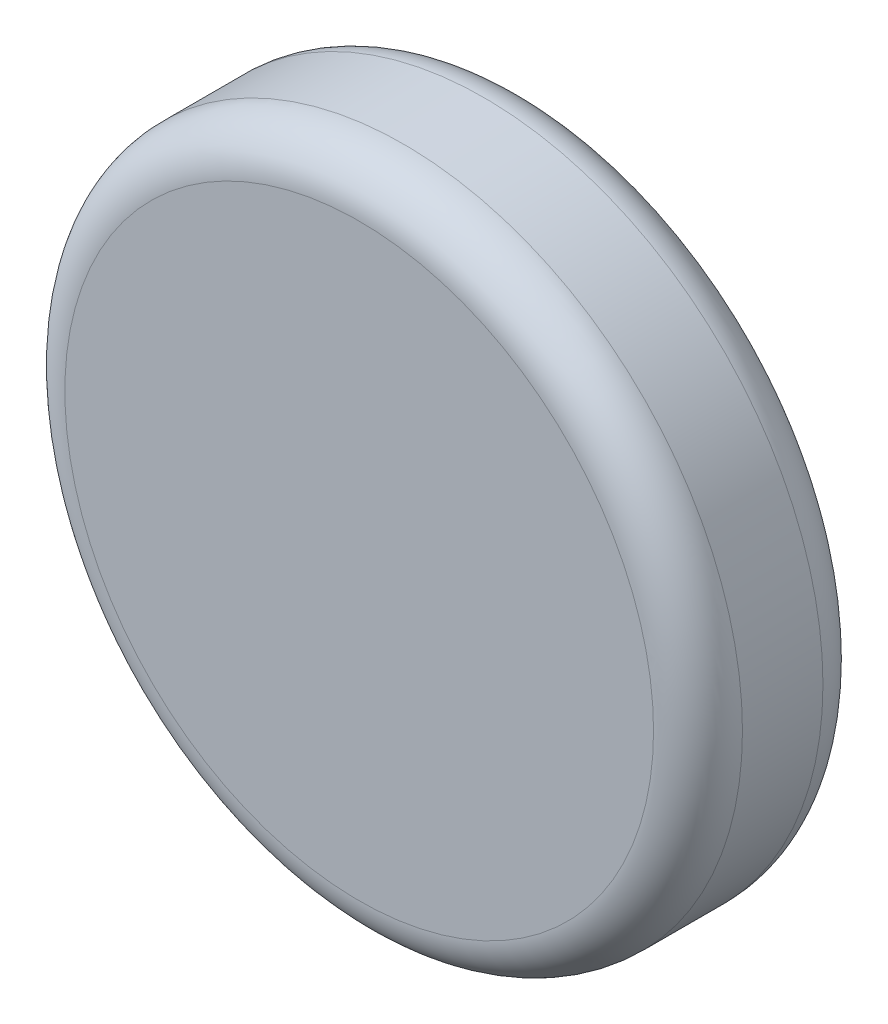
ISO-10303-21;
HEADER;
FILE_DESCRIPTION(('STEP AP214'),'2;1');
FILE_NAME('part.step','',(''),(''),'','','');
FILE_SCHEMA(('AUTOMOTIVE_DESIGN { 1 0 10303 214 1 1 1 1 }'));
ENDSEC;
DATA;
#1=APPLICATION_CONTEXT('core data for automotive mechanical design processes');
#2=APPLICATION_PROTOCOL_DEFINITION('international standard','automotive_design',2000,#1);
#3=PRODUCT_CONTEXT('',#1,'mechanical');
#4=PRODUCT('Part','Part','',(#3));
#5=PRODUCT_RELATED_PRODUCT_CATEGORY('part','',(#4));
#6=PRODUCT_DEFINITION_FORMATION('','',#4);
#7=PRODUCT_DEFINITION_CONTEXT('part definition',#1,'design');
#8=PRODUCT_DEFINITION('design','',#6,#7);
#9=PRODUCT_DEFINITION_SHAPE('','',#8);
#10=(LENGTH_UNIT() NAMED_UNIT(*) SI_UNIT(.MILLI.,.METRE.));
#11=(NAMED_UNIT(*) PLANE_ANGLE_UNIT() SI_UNIT($,.RADIAN.));
#12=(NAMED_UNIT(*) SI_UNIT($,.STERADIAN.) SOLID_ANGLE_UNIT());
#13=UNCERTAINTY_MEASURE_WITH_UNIT(LENGTH_MEASURE(1.E-05),#10,'distance_accuracy_value','');
#14=(GEOMETRIC_REPRESENTATION_CONTEXT(3) GLOBAL_UNCERTAINTY_ASSIGNED_CONTEXT((#13)) GLOBAL_UNIT_ASSIGNED_CONTEXT((#10,
#11,#12)) REPRESENTATION_CONTEXT('',''));
#15=CARTESIAN_POINT('',(0.,0.,0.));
#16=DIRECTION('',(0.,0.,1.));
#17=DIRECTION('',(1.,0.,0.));
#18=AXIS2_PLACEMENT_3D('',#15,#16,#17);
#19=CARTESIAN_POINT('',(0.,0.,76.2));
#20=DIRECTION('',(0.,0.,-1.));
#21=DIRECTION('',(-1.,0.,0.));
#22=AXIS2_PLACEMENT_3D('',#19,#20,#21);
#23=CYLINDRICAL_SURFACE('',#22,152.4);
#24=CARTESIAN_POINT('',(0.,0.,20.));
#25=DIRECTION('',(0.,0.,1.));
#26=DIRECTION('',(1.,0.,0.));
#27=AXIS2_PLACEMENT_3D('',#24,#25,#26);
#28=CIRCLE('',#27,152.4);
#29=CARTESIAN_POINT('',(152.4,0.,20.));
#30=VERTEX_POINT('',#29);
#31=EDGE_CURVE('E127',#30,#30,#28,.T.);
#32=ORIENTED_EDGE('',*,*,#31,.T.);
#33=EDGE_LOOP('',(#32));
#34=FACE_BOUND('',#33,.T.);
#35=CARTESIAN_POINT('',(0.,0.,56.2));
#36=DIRECTION('',(0.,0.,1.));
#37=DIRECTION('',(1.,0.,0.));
#38=AXIS2_PLACEMENT_3D('',#35,#36,#37);
#39=CIRCLE('',#38,152.4);
#40=CARTESIAN_POINT('',(152.4,0.,56.2));
#41=VERTEX_POINT('',#40);
#42=EDGE_CURVE('E129',#41,#41,#39,.F.);
#43=ORIENTED_EDGE('',*,*,#42,.T.);
#44=EDGE_LOOP('',(#43));
#45=FACE_BOUND('',#44,.T.);
#46=ADVANCED_FACE('F43',(#34,#45),#23,.T.);
#47=CARTESIAN_POINT('',(0.,0.,76.2));
#48=DIRECTION('',(0.,0.,1.));
#49=DIRECTION('',(1.,0.,0.));
#50=AXIS2_PLACEMENT_3D('',#47,#48,#49);
#51=PLANE('',#50);
#52=CARTESIAN_POINT('',(0.,0.,76.2));
#53=DIRECTION('',(0.,0.,1.));
#54=DIRECTION('',(1.,0.,0.));
#55=AXIS2_PLACEMENT_3D('',#52,#53,#54);
#56=CIRCLE('',#55,132.4);
#57=CARTESIAN_POINT('',(132.4,0.,76.2));
#58=VERTEX_POINT('',#57);
#59=EDGE_CURVE('E57',#58,#58,#56,.T.);
#60=ORIENTED_EDGE('',*,*,#59,.T.);
#61=EDGE_LOOP('',(#60));
#62=FACE_BOUND('',#61,.T.);
#63=ADVANCED_FACE('F103',(#62),#51,.T.);
#64=CARTESIAN_POINT('',(0.,0.,0.));
#65=DIRECTION('',(0.,0.,1.));
#66=DIRECTION('',(1.,0.,0.));
#67=AXIS2_PLACEMENT_3D('',#64,#65,#66);
#68=PLANE('',#67);
#69=CARTESIAN_POINT('',(0.,0.,0.));
#70=DIRECTION('',(0.,0.,1.));
#71=DIRECTION('',(1.,0.,0.));
#72=AXIS2_PLACEMENT_3D('',#69,#70,#71);
#73=CIRCLE('',#72,15.);
#74=CARTESIAN_POINT('',(15.,0.,0.));
#75=VERTEX_POINT('',#74);
#76=EDGE_CURVE('E10',#75,#75,#73,.F.);
#77=ORIENTED_EDGE('',*,*,#76,.F.);
#78=EDGE_LOOP('',(#77));
#79=FACE_BOUND('',#78,.T.);
#80=CARTESIAN_POINT('',(0.,0.,0.));
#81=DIRECTION('',(0.,0.,1.));
#82=DIRECTION('',(1.,0.,0.));
#83=AXIS2_PLACEMENT_3D('',#80,#81,#82);
#84=CIRCLE('',#83,132.4);
#85=CARTESIAN_POINT('',(132.4,0.,0.));
#86=VERTEX_POINT('',#85);
#87=EDGE_CURVE('E63',#86,#86,#84,.F.);
#88=ORIENTED_EDGE('',*,*,#87,.T.);
#89=EDGE_LOOP('',(#88));
#90=FACE_BOUND('',#89,.T.);
#91=ADVANCED_FACE('F107',(#79,#90),#68,.F.);
#92=CARTESIAN_POINT('',(0.,0.,20.));
#93=DIRECTION('',(0.,0.,1.));
#94=DIRECTION('',(1.,0.,0.));
#95=AXIS2_PLACEMENT_3D('',#92,#93,#94);
#96=TOROIDAL_SURFACE('',#95,132.4,20.);
#97=ORIENTED_EDGE('',*,*,#87,.F.);
#98=EDGE_LOOP('',(#97));
#99=FACE_BOUND('',#98,.T.);
#100=ORIENTED_EDGE('',*,*,#31,.F.);
#101=EDGE_LOOP('',(#100));
#102=FACE_BOUND('',#101,.T.);
#103=ADVANCED_FACE('F111',(#99,#102),#96,.T.);
#104=CARTESIAN_POINT('',(0.,0.,56.2));
#105=DIRECTION('',(0.,0.,1.));
#106=DIRECTION('',(1.,0.,0.));
#107=AXIS2_PLACEMENT_3D('',#104,#105,#106);
#108=TOROIDAL_SURFACE('',#107,132.4,20.);
#109=ORIENTED_EDGE('',*,*,#42,.F.);
#110=EDGE_LOOP('',(#109));
#111=FACE_BOUND('',#110,.T.);
#112=ORIENTED_EDGE('',*,*,#59,.F.);
#113=EDGE_LOOP('',(#112));
#114=FACE_BOUND('',#113,.T.);
#115=ADVANCED_FACE('F45',(#111,#114),#108,.T.);
#116=CARTESIAN_POINT('',(0.,0.,-45.));
#117=DIRECTION('',(0.,0.,-1.));
#118=DIRECTION('',(-1.,0.,0.));
#119=AXIS2_PLACEMENT_3D('',#116,#117,#118);
#120=PLANE('',#119);
#121=CARTESIAN_POINT('',(0.,0.,-45.));
#122=DIRECTION('',(0.,0.,-1.));
#123=DIRECTION('',(-1.,0.,0.));
#124=AXIS2_PLACEMENT_3D('',#121,#122,#123);
#125=CIRCLE('',#124,15.);
#126=CARTESIAN_POINT('',(-15.,0.,-45.));
#127=VERTEX_POINT('',#126);
#128=EDGE_CURVE('E134',#127,#127,#125,.T.);
#129=ORIENTED_EDGE('',*,*,#128,.T.);
#130=EDGE_LOOP('',(#129));
#131=FACE_BOUND('',#130,.T.);
#132=CARTESIAN_POINT('',(0.,0.,-45.));
#133=DIRECTION('',(0.,0.,-1.));
#134=DIRECTION('',(-1.,0.,0.));
#135=AXIS2_PLACEMENT_3D('',#132,#133,#134);
#136=CIRCLE('',#135,7.5);
#137=CARTESIAN_POINT('',(-7.5,0.,-45.));
#138=VERTEX_POINT('',#137);
#139=EDGE_CURVE('E140',#138,#138,#136,.T.);
#140=ORIENTED_EDGE('',*,*,#139,.F.);
#141=EDGE_LOOP('',(#140));
#142=FACE_BOUND('',#141,.T.);
#143=ADVANCED_FACE('F101',(#131,#142),#120,.T.);
#144=CARTESIAN_POINT('',(0.,0.,-45.));
#145=DIRECTION('',(0.,0.,1.));
#146=DIRECTION('',(1.,0.,0.));
#147=AXIS2_PLACEMENT_3D('',#144,#145,#146);
#148=CYLINDRICAL_SURFACE('',#147,15.);
#149=CARTESIAN_POINT('',(15.,0.,-33.1));
#150=CARTESIAN_POINT('',(14.9999968145247,-0.172165692568077,-33.0999938154299));
#151=CARTESIAN_POINT('',(14.997005579049,-0.34440834462399,-33.0856091189855));
#152=CARTESIAN_POINT('',(14.9853616038391,-0.684016768751709,-33.0285009423855));
#153=CARTESIAN_POINT('',(14.9767045230125,-0.851378698493541,-32.9857557324515));
#154=CARTESIAN_POINT('',(14.9546945810427,-1.17626714760313,-32.873310094182));
#155=CARTESIAN_POINT('',(14.9413463608244,-1.33380320695702,-32.8036362994153));
#156=CARTESIAN_POINT('',(14.9114015957254,-1.63494054093475,-32.6393923206272));
#157=CARTESIAN_POINT('',(14.8948052060611,-1.77854248092077,-32.5448233261673));
#158=CARTESIAN_POINT('',(14.8599203077403,-2.04981400261252,-32.3320292941861));
#159=CARTESIAN_POINT('',(14.841612714398,-2.17725387792715,-32.21351452613));
#160=CARTESIAN_POINT('',(14.8055061029318,-2.41059374938869,-31.956815694495));
#161=CARTESIAN_POINT('',(14.7877071265103,-2.51649198363875,-31.8186300235975));
#162=CARTESIAN_POINT('',(14.7544460628154,-2.70473262746812,-31.524843667008));
#163=CARTESIAN_POINT('',(14.7390084976833,-2.78683486689838,-31.3690860719536));
#164=CARTESIAN_POINT('',(14.7124902368737,-2.92361365563604,-31.0456142558885));
#165=CARTESIAN_POINT('',(14.7014090797868,-2.97829310959918,-30.8779013033545));
#166=CARTESIAN_POINT('',(14.6850518417562,-3.0579237824166,-30.5377581461236));
#167=CARTESIAN_POINT('',(14.6796968878264,-3.08327931876007,-30.365426467552));
#168=CARTESIAN_POINT('',(14.6751611480918,-3.10479871889511,-30.0188783611057));
#169=CARTESIAN_POINT('',(14.6759796871273,-3.10096577486347,-29.8446621414133));
#170=CARTESIAN_POINT('',(14.6836268744082,-3.06454338331475,-29.5022647660511));
#171=CARTESIAN_POINT('',(14.6903582036209,-3.03241955530402,-29.3340315807594));
#172=CARTESIAN_POINT('',(14.7089190681247,-2.941063176862,-29.0053950095459));
#173=CARTESIAN_POINT('',(14.7207488617187,-2.88182925294598,-28.8449920207829));
#174=CARTESIAN_POINT('',(14.7482719850807,-2.73749545783407,-28.535238650951));
#175=CARTESIAN_POINT('',(14.7639924411575,-2.65221295005861,-28.3859758822044));
#176=CARTESIAN_POINT('',(14.7975084496401,-2.45833155039526,-28.103705768882));
#177=CARTESIAN_POINT('',(14.8153042558583,-2.34972980522964,-27.9707004166468));
#178=CARTESIAN_POINT('',(14.8513860400371,-2.10980951412047,-27.7220359810143));
#179=CARTESIAN_POINT('',(14.8696748609556,-1.97809406671112,-27.6067599143946));
#180=CARTESIAN_POINT('',(14.9043690302707,-1.6969991798156,-27.3998755255774));
#181=CARTESIAN_POINT('',(14.920774351266,-1.54761948341342,-27.3082675476799));
#182=CARTESIAN_POINT('',(14.949897695655,-1.23499644988397,-27.1512407194381));
#183=CARTESIAN_POINT('',(14.9626092321176,-1.0717293661543,-27.0858678667747));
#184=CARTESIAN_POINT('',(14.9828639201261,-0.73620805030524,-26.9835872762513));
#185=CARTESIAN_POINT('',(14.9904077410196,-0.563954985205537,-26.9466758518503));
#186=CARTESIAN_POINT('',(14.9993830838028,-0.218640650723565,-26.9029132867294));
#187=CARTESIAN_POINT('',(15.0009211054796,-0.0456484522188003,-26.8955383200907));
#188=CARTESIAN_POINT('',(14.9980082795858,0.299096179156928,-26.9096441482863));
#189=CARTESIAN_POINT('',(14.9935577925971,0.47084868604657,-26.9311232057532));
#190=CARTESIAN_POINT('',(14.9792348501822,0.806532778422375,-27.0018924321905));
#191=CARTESIAN_POINT('',(14.9694152228943,0.970523916752351,-27.0509117538121));
#192=CARTESIAN_POINT('',(14.9454516233604,1.28795822388417,-27.1750724494127));
#193=CARTESIAN_POINT('',(14.9313073111298,1.44140056223109,-27.2502158771994));
#194=CARTESIAN_POINT('',(14.899998810058,1.73557589191959,-27.4256104314863));
#195=CARTESIAN_POINT('',(14.8827978643853,1.87611842957526,-27.5261742883141));
#196=CARTESIAN_POINT('',(14.8473663952166,2.13852141882694,-27.749138749663));
#197=CARTESIAN_POINT('',(14.8291357534649,2.26037971863338,-27.871541865818));
#198=CARTESIAN_POINT('',(14.7933375094228,2.4839940183808,-28.1371017759733));
#199=CARTESIAN_POINT('',(14.7757855941988,2.58538928856015,-28.2805648109525));
#200=CARTESIAN_POINT('',(14.7436744809272,2.76264557446456,-28.5827931781936));
#201=CARTESIAN_POINT('',(14.7291151591989,2.83850764553236,-28.7415578776553));
#202=CARTESIAN_POINT('',(14.704766460738,2.96206237859334,-29.0690613083987));
#203=CARTESIAN_POINT('',(14.6949515802098,3.00990595506135,-29.2377411176505));
#204=CARTESIAN_POINT('',(14.681151621117,3.07651834817522,-29.5809717861612));
#205=CARTESIAN_POINT('',(14.6771657237085,3.09529124863373,-29.755521817258));
#206=CARTESIAN_POINT('',(14.6755226409731,3.10307030783305,-30.1019111986467));
#207=CARTESIAN_POINT('',(14.6777441283759,3.0926471129851,-30.2737374093348));
#208=CARTESIAN_POINT('',(14.6879932817592,3.04359493211144,-30.6131298659779));
#209=CARTESIAN_POINT('',(14.6960208939033,3.00496620761724,-30.7806961514175));
#210=CARTESIAN_POINT('',(14.716921819634,2.90086151532538,-31.1064178089719));
#211=CARTESIAN_POINT('',(14.7297816752769,2.83546006555445,-31.264597918068));
#212=CARTESIAN_POINT('',(14.7589049039727,2.67973384395482,-31.5678279224072));
#213=CARTESIAN_POINT('',(14.7751685868093,2.58940680339968,-31.7128766208329));
#214=CARTESIAN_POINT('',(14.809635154064,2.38446392361928,-31.9885581650979));
#215=CARTESIAN_POINT('',(14.8278678241242,2.26943782754737,-32.1188823572029));
#216=CARTESIAN_POINT('',(14.8640090653401,2.0192037716277,-32.3585670545696));
#217=CARTESIAN_POINT('',(14.8819175609528,1.88399117387355,-32.4679227290303));
#218=CARTESIAN_POINT('',(14.9156320795551,1.59538198786285,-32.6637403862318));
#219=CARTESIAN_POINT('',(14.931412025711,1.44179699181803,-32.7499293813119));
#220=CARTESIAN_POINT('',(14.9588332815734,1.1220352287178,-32.8951361118284));
#221=CARTESIAN_POINT('',(14.9704782304995,0.955869690892325,-32.9541777532715));
#222=CARTESIAN_POINT('',(14.9861185683186,0.657833295489247,-33.0322927137901));
#223=CARTESIAN_POINT('',(14.9912930325766,0.527631279793745,-33.0576365966745));
#224=CARTESIAN_POINT('',(14.9982349131395,0.26496798438754,-33.0914923177754));
#225=CARTESIAN_POINT('',(15.0000024516911,0.132506785912505,-33.100004759935));
#226=CARTESIAN_POINT('',(15.,0.,-33.1));
#227=B_SPLINE_CURVE_WITH_KNOTS('',3,(#149,#150,#151,#152,#153,#154,#155,#156,#157,#158,#159,
#160,#161,#162,#163,#164,#165,#166,#167,#168,#169,#170,#171,#172,#173,#174,#175,#176,#177,#178,
#179,#180,#181,#182,#183,#184,#185,#186,#187,#188,#189,#190,#191,#192,#193,#194,#195,#196,#197,
#198,#199,#200,#201,#202,#203,#204,#205,#206,#207,#208,#209,#210,#211,#212,#213,#214,#215,#216,
#217,#218,#219,#220,#221,#222,#223,#224,#225,#226),.UNSPECIFIED.,.T.,.F.,(4,2,2,2,2,2,2,2,2,2,2,
2,2,2,2,2,2,2,2,2,2,2,2,2,2,2,2,2,2,2,2,2,2,2,2,2,2,2,4),(0.,0.516012233354284,1.03242029170925,
1.54831890115688,2.06419286401492,2.58672901286765,3.10930788292942,3.6369907466094,
4.16461770564987,4.68487960325838,5.20508460362239,5.71688465009025,6.22871062886658,
6.7442109601948,7.25977440270467,7.785258180058,8.3107496012018,8.83715837566197,
9.36349895418803,9.88046246952421,10.3973948586867,10.9093302438092,11.4213058850334,
11.939915752659,12.4585853017376,12.985723935975,13.5128407797482,14.0370916901281,
14.5612689477046,15.0752728884933,15.5892720633186,16.1018502189676,16.614475044861,
17.1363837856733,17.6584126215689,18.1863470781733,18.713815740192,19.1109771901377,
19.5081243889403),.UNSPECIFIED.);
#228=CARTESIAN_POINT('',(15.,0.,-33.1));
#229=VERTEX_POINT('',#228);
#230=EDGE_CURVE('E92',#229,#229,#227,.T.);
#231=ORIENTED_EDGE('',*,*,#230,.T.);
#232=EDGE_LOOP('',(#231));
#233=FACE_BOUND('',#232,.T.);
#234=CARTESIAN_POINT('',(-15.,0.,-33.1));
#235=CARTESIAN_POINT('',(-14.9999968145247,0.172165692568076,-33.0999938154299));
#236=CARTESIAN_POINT('',(-14.997005579049,0.344408344623986,-33.0856091189855));
#237=CARTESIAN_POINT('',(-14.9853616038391,0.684016768751703,-33.0285009423855));
#238=CARTESIAN_POINT('',(-14.9767045230125,0.851378698493535,-32.9857557324515));
#239=CARTESIAN_POINT('',(-14.9546945810427,1.17626714760312,-32.873310094182));
#240=CARTESIAN_POINT('',(-14.9413463608244,1.33380320695702,-32.8036362994154));
#241=CARTESIAN_POINT('',(-14.9114015957254,1.63494054093474,-32.6393923206273));
#242=CARTESIAN_POINT('',(-14.8948052060611,1.77854248092076,-32.5448233261673));
#243=CARTESIAN_POINT('',(-14.8599203077403,2.04981400261251,-32.3320292941862));
#244=CARTESIAN_POINT('',(-14.841612714398,2.17725387792714,-32.21351452613));
#245=CARTESIAN_POINT('',(-14.8055061029318,2.41059374938868,-31.956815694495));
#246=CARTESIAN_POINT('',(-14.7877071265103,2.51649198363874,-31.8186300235975));
#247=CARTESIAN_POINT('',(-14.7544460628154,2.70473262746811,-31.524843667008));
#248=CARTESIAN_POINT('',(-14.7390084976833,2.78683486689837,-31.3690860719536));
#249=CARTESIAN_POINT('',(-14.7124902368737,2.92361365563604,-31.0456142558885));
#250=CARTESIAN_POINT('',(-14.7014090797868,2.97829310959917,-30.8779013033545));
#251=CARTESIAN_POINT('',(-14.6850518417562,3.0579237824166,-30.5377581461236));
#252=CARTESIAN_POINT('',(-14.6796968878264,3.08327931876007,-30.365426467552));
#253=CARTESIAN_POINT('',(-14.6751611480918,3.10479871889511,-30.0188783611057));
#254=CARTESIAN_POINT('',(-14.6759796871273,3.10096577486347,-29.8446621414133));
#255=CARTESIAN_POINT('',(-14.6836268744082,3.06454338331475,-29.5022647660511));
#256=CARTESIAN_POINT('',(-14.6903582036209,3.03241955530402,-29.3340315807594));
#257=CARTESIAN_POINT('',(-14.7089190681247,2.941063176862,-29.0053950095459));
#258=CARTESIAN_POINT('',(-14.7207488617187,2.88182925294598,-28.8449920207829));
#259=CARTESIAN_POINT('',(-14.7482719850807,2.73749545783407,-28.535238650951));
#260=CARTESIAN_POINT('',(-14.7639924411575,2.65221295005861,-28.3859758822044));
#261=CARTESIAN_POINT('',(-14.7975084496401,2.45833155039526,-28.1037057688819));
#262=CARTESIAN_POINT('',(-14.8153042558583,2.34972980522964,-27.9707004166468));
#263=CARTESIAN_POINT('',(-14.8513860400371,2.10980951412047,-27.7220359810143));
#264=CARTESIAN_POINT('',(-14.8696748609556,1.97809406671111,-27.6067599143946));
#265=CARTESIAN_POINT('',(-14.9043690302707,1.6969991798156,-27.3998755255774));
#266=CARTESIAN_POINT('',(-14.920774351266,1.54761948341341,-27.3082675476799));
#267=CARTESIAN_POINT('',(-14.949897695655,1.23499644988396,-27.1512407194381));
#268=CARTESIAN_POINT('',(-14.9626092321176,1.07172936615429,-27.0858678667747));
#269=CARTESIAN_POINT('',(-14.9828639201261,0.736208050305231,-26.9835872762513));
#270=CARTESIAN_POINT('',(-14.9904077410196,0.56395498520553,-26.9466758518503));
#271=CARTESIAN_POINT('',(-14.9993830838028,0.21864065072356,-26.9029132867294));
#272=CARTESIAN_POINT('',(-15.0009211054796,0.0456484522187959,-26.8955383200907));
#273=CARTESIAN_POINT('',(-14.9980082795858,-0.29909617915693,-26.9096441482863));
#274=CARTESIAN_POINT('',(-14.9935577925971,-0.470848686046571,-26.9311232057532));
#275=CARTESIAN_POINT('',(-14.9792348501822,-0.806532778422374,-27.0018924321905));
#276=CARTESIAN_POINT('',(-14.9694152228943,-0.970523916752348,-27.0509117538121));
#277=CARTESIAN_POINT('',(-14.9454516233604,-1.28795822388416,-27.1750724494127));
#278=CARTESIAN_POINT('',(-14.9313073111298,-1.44140056223109,-27.2502158771994));
#279=CARTESIAN_POINT('',(-14.899998810058,-1.73557589191958,-27.4256104314863));
#280=CARTESIAN_POINT('',(-14.8827978643853,-1.87611842957525,-27.5261742883141));
#281=CARTESIAN_POINT('',(-14.8473663952166,-2.13852141882693,-27.749138749663));
#282=CARTESIAN_POINT('',(-14.8291357534649,-2.26037971863337,-27.871541865818));
#283=CARTESIAN_POINT('',(-14.7933375094228,-2.4839940183808,-28.1371017759733));
#284=CARTESIAN_POINT('',(-14.7757855941988,-2.58538928856014,-28.2805648109525));
#285=CARTESIAN_POINT('',(-14.7436744809272,-2.76264557446456,-28.5827931781936));
#286=CARTESIAN_POINT('',(-14.7291151591989,-2.83850764553235,-28.7415578776553));
#287=CARTESIAN_POINT('',(-14.704766460738,-2.96206237859333,-29.0690613083986));
#288=CARTESIAN_POINT('',(-14.6949515802098,-3.00990595506135,-29.2377411176505));
#289=CARTESIAN_POINT('',(-14.681151621117,-3.07651834817522,-29.5809717861612));
#290=CARTESIAN_POINT('',(-14.6771657237085,-3.09529124863373,-29.7555218172579));
#291=CARTESIAN_POINT('',(-14.6755226409731,-3.10307030783305,-30.1019111986467));
#292=CARTESIAN_POINT('',(-14.6777441283759,-3.0926471129851,-30.2737374093348));
#293=CARTESIAN_POINT('',(-14.6879932817592,-3.04359493211144,-30.6131298659779));
#294=CARTESIAN_POINT('',(-14.6960208939033,-3.00496620761724,-30.7806961514175));
#295=CARTESIAN_POINT('',(-14.716921819634,-2.90086151532538,-31.1064178089719));
#296=CARTESIAN_POINT('',(-14.7297816752769,-2.83546006555445,-31.264597918068));
#297=CARTESIAN_POINT('',(-14.7589049039727,-2.67973384395482,-31.5678279224072));
#298=CARTESIAN_POINT('',(-14.7751685868093,-2.58940680339968,-31.7128766208329));
#299=CARTESIAN_POINT('',(-14.809635154064,-2.38446392361928,-31.9885581650979));
#300=CARTESIAN_POINT('',(-14.8278678241242,-2.26943782754737,-32.1188823572029));
#301=CARTESIAN_POINT('',(-14.8640090653401,-2.0192037716277,-32.3585670545696));
#302=CARTESIAN_POINT('',(-14.8819175609528,-1.88399117387355,-32.4679227290303));
#303=CARTESIAN_POINT('',(-14.9156320795551,-1.59538198786285,-32.6637403862318));
#304=CARTESIAN_POINT('',(-14.931412025711,-1.44179699181802,-32.7499293813119));
#305=CARTESIAN_POINT('',(-14.9588332815734,-1.12203522871779,-32.8951361118284));
#306=CARTESIAN_POINT('',(-14.9704782304995,-0.955869690892318,-32.9541777532715));
#307=CARTESIAN_POINT('',(-14.9861185683186,-0.65783329548924,-33.0322927137901));
#308=CARTESIAN_POINT('',(-14.9912930325766,-0.52763127979374,-33.0576365966745));
#309=CARTESIAN_POINT('',(-14.9982349131395,-0.264967984387537,-33.0914923177754));
#310=CARTESIAN_POINT('',(-15.0000024516911,-0.132506785912504,-33.100004759935));
#311=CARTESIAN_POINT('',(-15.,0.,-33.1));
#312=B_SPLINE_CURVE_WITH_KNOTS('',3,(#234,#235,#236,#237,#238,#239,#240,#241,#242,#243,#244,
#245,#246,#247,#248,#249,#250,#251,#252,#253,#254,#255,#256,#257,#258,#259,#260,#261,#262,#263,
#264,#265,#266,#267,#268,#269,#270,#271,#272,#273,#274,#275,#276,#277,#278,#279,#280,#281,#282,
#283,#284,#285,#286,#287,#288,#289,#290,#291,#292,#293,#294,#295,#296,#297,#298,#299,#300,#301,
#302,#303,#304,#305,#306,#307,#308,#309,#310,#311),.UNSPECIFIED.,.T.,.F.,(4,2,2,2,2,2,2,2,2,2,2,
2,2,2,2,2,2,2,2,2,2,2,2,2,2,2,2,2,2,2,2,2,2,2,2,2,2,2,4),(0.,0.516012233354279,1.03242029170924,
1.54831890115688,2.06419286401491,2.58672901286763,3.10930788292939,3.63699074660938,
4.16461770564985,4.68487960325837,5.20508460362238,5.71688465009025,6.22871062886658,
6.7442109601948,7.25977440270467,7.78525818005801,8.31074960120181,8.83715837566198,
9.36349895418804,9.88046246952421,10.3973948586867,10.9093302438092,11.4213058850333,
11.939915752659,12.4585853017376,12.985723935975,13.5128407797482,14.0370916901281,
14.5612689477046,15.0752728884933,15.5892720633186,16.1018502189676,16.614475044861,
17.1363837856733,17.6584126215689,18.1863470781733,18.713815740192,19.1109771901377,
19.5081243889403),.UNSPECIFIED.);
#313=CARTESIAN_POINT('',(-15.,0.,-33.1));
#314=VERTEX_POINT('',#313);
#315=EDGE_CURVE('E85',#314,#314,#312,.T.);
#316=ORIENTED_EDGE('',*,*,#315,.T.);
#317=EDGE_LOOP('',(#316));
#318=FACE_BOUND('',#317,.T.);
#319=ORIENTED_EDGE('',*,*,#128,.F.);
#320=EDGE_LOOP('',(#319));
#321=FACE_BOUND('',#320,.T.);
#322=ORIENTED_EDGE('',*,*,#76,.T.);
#323=EDGE_LOOP('',(#322));
#324=FACE_BOUND('',#323,.T.);
#325=ADVANCED_FACE('F97',(#233,#318,#321,#324),#148,.T.);
#326=CARTESIAN_POINT('',(0.,0.,-45.));
#327=DIRECTION('',(0.,0.,1.));
#328=DIRECTION('',(1.,0.,0.));
#329=AXIS2_PLACEMENT_3D('',#326,#327,#328);
#330=CYLINDRICAL_SURFACE('',#329,7.5);
#331=CARTESIAN_POINT('',(7.5,0.,-33.1));
#332=CARTESIAN_POINT('',(7.49999499657015,-0.166153002613098,-33.0999935608613));
#333=CARTESIAN_POINT('',(7.49441556709234,-0.332600464403832,-33.0865628973927));
#334=CARTESIAN_POINT('',(7.47265556326767,-0.66076876100353,-33.0333405430206));
#335=CARTESIAN_POINT('',(7.4564470859861,-0.822475981409239,-32.9934794650196));
#336=CARTESIAN_POINT('',(7.41516232897275,-1.13589928883873,-32.8891021697658));
#337=CARTESIAN_POINT('',(7.39011591076245,-1.28764700409264,-32.8246689181735));
#338=CARTESIAN_POINT('',(7.33360222650621,-1.57803340286614,-32.67331942222));
#339=CARTESIAN_POINT('',(7.30213696318031,-1.71667615552023,-32.5864101882476));
#340=CARTESIAN_POINT('',(7.2341955467982,-1.98400959910198,-32.3880223537403));
#341=CARTESIAN_POINT('',(7.1975569991194,-2.11196525773687,-32.275609331583));
#342=CARTESIAN_POINT('',(7.12411042208018,-2.34783768718457,-32.0313800707794));
#343=CARTESIAN_POINT('',(7.0873023148786,-2.45574406182105,-31.8995538289288));
#344=CARTESIAN_POINT('',(7.01570032840252,-2.65359473144152,-31.6125285990487));
#345=CARTESIAN_POINT('',(6.98108925988134,-2.74242148647986,-31.4565089045961));
#346=CARTESIAN_POINT('',(6.92036974270419,-2.89224243961146,-31.1301032580336));
#347=CARTESIAN_POINT('',(6.89425698486144,-2.95325074974892,-30.9597246421662));
#348=CARTESIAN_POINT('',(6.8552453498953,-3.04268024888774,-30.6178959087351));
#349=CARTESIAN_POINT('',(6.84177651513844,-3.07251470951096,-30.4468830608682));
#350=CARTESIAN_POINT('',(6.82793602371857,-3.10316007729674,-30.1017889414622));
#351=CARTESIAN_POINT('',(6.82755730769831,-3.1039866281101,-29.9277093744537));
#352=CARTESIAN_POINT('',(6.83945669009682,-3.07765851268916,-29.5953968828514));
#353=CARTESIAN_POINT('',(6.85078502883839,-3.05260360053316,-29.4369568069882));
#354=CARTESIAN_POINT('',(6.88321931438638,-2.9787415805769,-29.1267718712863));
#355=CARTESIAN_POINT('',(6.90432709889237,-2.9299300084689,-28.9750282756858));
#356=CARTESIAN_POINT('',(6.95441629953129,-2.80899254802326,-28.67874504467));
#357=CARTESIAN_POINT('',(6.98355455159122,-2.73639615555452,-28.5344251648985));
#358=CARTESIAN_POINT('',(7.04638370508447,-2.57028194875634,-28.2594607519968));
#359=CARTESIAN_POINT('',(7.0800763834253,-2.47675595937096,-28.1288215918758));
#360=CARTESIAN_POINT('',(7.15162260147758,-2.26231791362188,-27.8735098261304));
#361=CARTESIAN_POINT('',(7.18958932893572,-2.1397766602239,-27.7502334767264));
#362=CARTESIAN_POINT('',(7.26304146095989,-1.87537753928265,-27.5255166615304));
#363=CARTESIAN_POINT('',(7.29852630128623,-1.73351530071416,-27.4240811502758));
#364=CARTESIAN_POINT('',(7.3640172601883,-1.43031567972322,-27.2439222418407));
#365=CARTESIAN_POINT('',(7.3938829557076,-1.26861343015351,-27.1657580866915));
#366=CARTESIAN_POINT('',(7.44369617955768,-0.932805541489837,-27.0382299604476));
#367=CARTESIAN_POINT('',(7.46364909848067,-0.758706702716554,-26.9888503337177));
#368=CARTESIAN_POINT('',(7.49038660533013,-0.414723271042769,-26.9231952975378));
#369=CARTESIAN_POINT('',(7.49791555875999,-0.245254188339049,-26.9050455653783));
#370=CARTESIAN_POINT('',(7.50132646954416,0.0944609767199248,-26.896788462455));
#371=CARTESIAN_POINT('',(7.4972117034244,0.264706827033574,-26.9066732028326));
#372=CARTESIAN_POINT('',(7.4782813005357,0.592423142194313,-26.9528549999108));
#373=CARTESIAN_POINT('',(7.46399615818736,0.750112133817272,-26.987843312039));
#374=CARTESIAN_POINT('',(7.42672470407196,1.05721523253207,-27.0814258903456));
#375=CARTESIAN_POINT('',(7.40373728888471,1.20662828750663,-27.1400231501231));
#376=CARTESIAN_POINT('',(7.35038535240201,1.49816127489849,-27.2810756714788));
#377=CARTESIAN_POINT('',(7.31981428517995,1.63991168325744,-27.3642140374976));
#378=CARTESIAN_POINT('',(7.25456871961594,1.90795528937436,-27.5512368218626));
#379=CARTESIAN_POINT('',(7.21989252291916,2.03424204531877,-27.6551298390308));
#380=CARTESIAN_POINT('',(7.14716389966531,2.27711097618435,-27.88927079263));
#381=CARTESIAN_POINT('',(7.10904560593692,2.39238480652962,-28.0208588825949));
#382=CARTESIAN_POINT('',(7.03593167919986,2.59957048468991,-28.3021338598589));
#383=CARTESIAN_POINT('',(7.00093671485366,2.6914773377003,-28.4518246066147));
#384=CARTESIAN_POINT('',(6.93784170380673,2.85022442048549,-28.7679691973087));
#385=CARTESIAN_POINT('',(6.90983935005116,2.91671570889456,-28.9346191853212));
#386=CARTESIAN_POINT('',(6.86527482101637,3.02013779062218,-29.2782684466691));
#387=CARTESIAN_POINT('',(6.8487034167944,3.0570924346134,-29.4552592456644));
#388=CARTESIAN_POINT('',(6.83027124265743,3.09804010789087,-29.8000735733258));
#389=CARTESIAN_POINT('',(6.82738831148696,3.10432447712997,-29.9675717055273));
#390=CARTESIAN_POINT('',(6.8339513608338,3.08985007296316,-30.3011319351771));
#391=CARTESIAN_POINT('',(6.84339551988094,3.06909529490486,-30.467194241136));
#392=CARTESIAN_POINT('',(6.87262082828987,3.00304618929307,-30.7854634318842));
#393=CARTESIAN_POINT('',(6.89191674393384,2.9589003999752,-30.9379574412136));
#394=CARTESIAN_POINT('',(6.93829866651057,2.84843476313013,-31.2334150077483));
#395=CARTESIAN_POINT('',(6.96538685481484,2.78210870560486,-31.3763758824211));
#396=CARTESIAN_POINT('',(7.0263027906572,2.62461324834436,-31.6580014075059));
#397=CARTESIAN_POINT('',(7.06043592217452,2.5321991343525,-31.7959026215722));
#398=CARTESIAN_POINT('',(7.13072826622724,2.32690149913445,-32.05495975473));
#399=CARTESIAN_POINT('',(7.16688816027646,2.21401106371447,-32.1761099931307));
#400=CARTESIAN_POINT('',(7.24024921308954,1.96144980129082,-32.4070838478178));
#401=CARTESIAN_POINT('',(7.27734125674949,1.82044465095394,-32.5154872431363));
#402=CARTESIAN_POINT('',(7.34580237908539,1.52076323380496,-32.7071873411934));
#403=CARTESIAN_POINT('',(7.37716883966076,1.36207893610269,-32.7904725696053));
#404=CARTESIAN_POINT('',(7.4170196735755,1.11564028430045,-32.8936380574752));
#405=CARTESIAN_POINT('',(7.42903456588251,1.03279444562305,-32.9242374185663));
#406=CARTESIAN_POINT('',(7.45049041775362,0.864502653411417,-32.9783267473089));
#407=CARTESIAN_POINT('',(7.45993259430366,0.779057950570124,-33.0018200769469));
#408=CARTESIAN_POINT('',(7.4759436159557,0.60643903053414,-33.0413908362303));
#409=CARTESIAN_POINT('',(7.48251958049345,0.519269667431423,-33.0574866461918));
#410=CARTESIAN_POINT('',(7.49263353478285,0.343742028836125,-33.0821559186493));
#411=CARTESIAN_POINT('',(7.49617376860472,0.255384680685463,-33.0907349378035));
#412=CARTESIAN_POINT('',(7.49876251103851,0.139047150358921,-33.0970050544319));
#413=CARTESIAN_POINT('',(7.4992261831606,0.111252100871384,-33.0981276757651));
#414=CARTESIAN_POINT('',(7.4998453469052,0.055640786883673,-33.099625688481));
#415=CARTESIAN_POINT('',(7.50000083789064,0.0278245223397621,-33.1000010783191));
#416=CARTESIAN_POINT('',(7.5,0.,-33.1));
#417=B_SPLINE_CURVE_WITH_KNOTS('',3,(#331,#332,#333,#334,#335,#336,#337,#338,#339,#340,#341,
#342,#343,#344,#345,#346,#347,#348,#349,#350,#351,#352,#353,#354,#355,#356,#357,#358,#359,#360,
#361,#362,#363,#364,#365,#366,#367,#368,#369,#370,#371,#372,#373,#374,#375,#376,#377,#378,#379,
#380,#381,#382,#383,#384,#385,#386,#387,#388,#389,#390,#391,#392,#393,#394,#395,#396,#397,#398,
#399,#400,#401,#402,#403,#404,#405,#406,#407,#408,#409,#410,#411,#412,#413,#414,#415,#416),
.UNSPECIFIED.,.T.,.F.,(4,2,2,2,2,2,2,2,2,2,2,2,2,2,2,2,2,2,2,2,2,2,2,2,2,2,2,2,2,2,2,2,2,2,2,2,
2,2,2,2,2,2,4),(0.,0.498350072093017,0.998013657586008,1.49600490175055,1.99384100650712,
2.51422237468696,3.03487282828195,3.58063836896805,4.12612673889397,4.6456426340429,
5.16487835560281,5.64506306376062,6.12533804220394,6.61575367999808,7.10636120848082,
7.63770794739145,8.16917509423633,8.71253919590834,9.25560749053011,9.76477034291974,
10.2737899318645,10.7580384666161,11.2423484231004,11.7416676385667,12.2411941567273,
12.7758736132642,13.3106672642191,13.8525600209147,14.3940147589523,14.8943247334462,
15.394560789723,15.8722439818827,16.3500610271901,16.8563461469573,17.3628025422319,
17.9053115722874,18.4480680539121,18.7151630289679,18.9821314383947,19.2484328877127,
19.5145373117832,19.5979924635495,19.6814477878343),.UNSPECIFIED.);
#418=CARTESIAN_POINT('',(7.5,0.,-33.1));
#419=VERTEX_POINT('',#418);
#420=EDGE_CURVE('E47',#419,#419,#417,.T.);
#421=ORIENTED_EDGE('',*,*,#420,.F.);
#422=EDGE_LOOP('',(#421));
#423=FACE_BOUND('',#422,.T.);
#424=CARTESIAN_POINT('',(-7.5,0.,-33.1));
#425=CARTESIAN_POINT('',(-7.49999499657015,0.166153002613095,-33.0999935608613));
#426=CARTESIAN_POINT('',(-7.49441556709234,0.332600464403826,-33.0865628973927));
#427=CARTESIAN_POINT('',(-7.47265556326767,0.660768761003522,-33.0333405430206));
#428=CARTESIAN_POINT('',(-7.4564470859861,0.822475981409231,-32.9934794650196));
#429=CARTESIAN_POINT('',(-7.41516232897275,1.13589928883872,-32.8891021697658));
#430=CARTESIAN_POINT('',(-7.39011591076245,1.28764700409263,-32.8246689181736));
#431=CARTESIAN_POINT('',(-7.33360222650622,1.57803340286612,-32.67331942222));
#432=CARTESIAN_POINT('',(-7.30213696318032,1.71667615552021,-32.5864101882476));
#433=CARTESIAN_POINT('',(-7.23419554679821,1.98400959910197,-32.3880223537403));
#434=CARTESIAN_POINT('',(-7.19755699911941,2.11196525773685,-32.275609331583));
#435=CARTESIAN_POINT('',(-7.12411042208018,2.34783768718456,-32.0313800707795));
#436=CARTESIAN_POINT('',(-7.08730231487861,2.45574406182103,-31.8995538289288));
#437=CARTESIAN_POINT('',(-7.01570032840252,2.6535947314415,-31.6125285990487));
#438=CARTESIAN_POINT('',(-6.98108925988135,2.74242148647985,-31.4565089045961));
#439=CARTESIAN_POINT('',(-6.92036974270419,2.89224243961145,-31.1301032580337));
#440=CARTESIAN_POINT('',(-6.89425698486144,2.95325074974891,-30.9597246421663));
#441=CARTESIAN_POINT('',(-6.8552453498953,3.04268024888774,-30.6178959087351));
#442=CARTESIAN_POINT('',(-6.84177651513844,3.07251470951096,-30.4468830608682));
#443=CARTESIAN_POINT('',(-6.82793602371857,3.10316007729674,-30.1017889414622));
#444=CARTESIAN_POINT('',(-6.82755730769831,3.1039866281101,-29.9277093744537));
#445=CARTESIAN_POINT('',(-6.83945669009682,3.07765851268916,-29.5953968828515));
#446=CARTESIAN_POINT('',(-6.85078502883838,3.05260360053317,-29.4369568069882));
#447=CARTESIAN_POINT('',(-6.88321931438638,2.9787415805769,-29.1267718712863));
#448=CARTESIAN_POINT('',(-6.90432709889237,2.9299300084689,-28.9750282756858));
#449=CARTESIAN_POINT('',(-6.95441629953129,2.80899254802326,-28.67874504467));
#450=CARTESIAN_POINT('',(-6.98355455159122,2.73639615555453,-28.5344251648985));
#451=CARTESIAN_POINT('',(-7.04638370508447,2.57028194875634,-28.2594607519968));
#452=CARTESIAN_POINT('',(-7.0800763834253,2.47675595937095,-28.1288215918758));
#453=CARTESIAN_POINT('',(-7.15162260147758,2.26231791362188,-27.8735098261304));
#454=CARTESIAN_POINT('',(-7.18958932893573,2.13977666022389,-27.7502334767264));
#455=CARTESIAN_POINT('',(-7.26304146095989,1.87537753928264,-27.5255166615304));
#456=CARTESIAN_POINT('',(-7.29852630128624,1.73351530071414,-27.4240811502758));
#457=CARTESIAN_POINT('',(-7.3640172601883,1.4303156797232,-27.2439222418406));
#458=CARTESIAN_POINT('',(-7.3938829557076,1.2686134301535,-27.1657580866914));
#459=CARTESIAN_POINT('',(-7.44369617955768,0.932805541489822,-27.0382299604476));
#460=CARTESIAN_POINT('',(-7.46364909848067,0.758706702716539,-26.9888503337177));
#461=CARTESIAN_POINT('',(-7.49038660533013,0.414723271042757,-26.9231952975378));
#462=CARTESIAN_POINT('',(-7.49791555875999,0.245254188339039,-26.9050455653783));
#463=CARTESIAN_POINT('',(-7.50132646954416,-0.0944609767199308,-26.896788462455));
#464=CARTESIAN_POINT('',(-7.4972117034244,-0.264706827033577,-26.9066732028326));
#465=CARTESIAN_POINT('',(-7.4782813005357,-0.592423142194313,-26.9528549999108));
#466=CARTESIAN_POINT('',(-7.46399615818736,-0.75011213381727,-26.987843312039));
#467=CARTESIAN_POINT('',(-7.42672470407196,-1.05721523253206,-27.0814258903456));
#468=CARTESIAN_POINT('',(-7.40373728888471,-1.20662828750662,-27.1400231501231));
#469=CARTESIAN_POINT('',(-7.35038535240201,-1.49816127489848,-27.2810756714788));
#470=CARTESIAN_POINT('',(-7.31981428517995,-1.63991168325742,-27.3642140374976));
#471=CARTESIAN_POINT('',(-7.25456871961595,-1.90795528937434,-27.5512368218625));
#472=CARTESIAN_POINT('',(-7.21989252291917,-2.03424204531875,-27.6551298390308));
#473=CARTESIAN_POINT('',(-7.14716389966531,-2.27711097618433,-27.88927079263));
#474=CARTESIAN_POINT('',(-7.10904560593693,-2.3923848065296,-28.0208588825949));
#475=CARTESIAN_POINT('',(-7.03593167919986,-2.59957048468989,-28.3021338598588));
#476=CARTESIAN_POINT('',(-7.00093671485367,-2.69147733770028,-28.4518246066147));
#477=CARTESIAN_POINT('',(-6.93784170380673,-2.85022442048548,-28.7679691973087));
#478=CARTESIAN_POINT('',(-6.90983935005117,-2.91671570889455,-28.9346191853212));
#479=CARTESIAN_POINT('',(-6.86527482101638,-3.02013779062217,-29.2782684466691));
#480=CARTESIAN_POINT('',(-6.84870341679441,-3.05709243461339,-29.4552592456644));
#481=CARTESIAN_POINT('',(-6.83027124265743,-3.09804010789087,-29.8000735733258));
#482=CARTESIAN_POINT('',(-6.82738831148696,-3.10432447712997,-29.9675717055273));
#483=CARTESIAN_POINT('',(-6.8339513608338,-3.08985007296316,-30.3011319351771));
#484=CARTESIAN_POINT('',(-6.84339551988094,-3.06909529490486,-30.467194241136));
#485=CARTESIAN_POINT('',(-6.87262082828987,-3.00304618929307,-30.7854634318842));
#486=CARTESIAN_POINT('',(-6.89191674393384,-2.9589003999752,-30.9379574412136));
#487=CARTESIAN_POINT('',(-6.93829866651058,-2.84843476313013,-31.2334150077483));
#488=CARTESIAN_POINT('',(-6.96538685481484,-2.78210870560486,-31.3763758824212));
#489=CARTESIAN_POINT('',(-7.0263027906572,-2.62461324834436,-31.6580014075059));
#490=CARTESIAN_POINT('',(-7.06043592217452,-2.53219913435249,-31.7959026215722));
#491=CARTESIAN_POINT('',(-7.13072826622725,-2.32690149913444,-32.05495975473));
#492=CARTESIAN_POINT('',(-7.16688816027646,-2.21401106371446,-32.1761099931307));
#493=CARTESIAN_POINT('',(-7.24024921308954,-1.96144980129081,-32.4070838478178));
#494=CARTESIAN_POINT('',(-7.2773412567495,-1.82044465095393,-32.5154872431363));
#495=CARTESIAN_POINT('',(-7.34580237908539,-1.52076323380494,-32.7071873411934));
#496=CARTESIAN_POINT('',(-7.37716883966076,-1.36207893610267,-32.7904725696053));
#497=CARTESIAN_POINT('',(-7.4170196735755,-1.11564028430044,-32.8936380574752));
#498=CARTESIAN_POINT('',(-7.42903456588252,-1.03279444562304,-32.9242374185663));
#499=CARTESIAN_POINT('',(-7.45049041775363,-0.864502653411402,-32.978326747309));
#500=CARTESIAN_POINT('',(-7.45993259430367,-0.77905795057011,-33.001820076947));
#501=CARTESIAN_POINT('',(-7.4759436159557,-0.606439030534127,-33.0413908362304));
#502=CARTESIAN_POINT('',(-7.48251958049345,-0.519269667431409,-33.0574866461918));
#503=CARTESIAN_POINT('',(-7.49263353478285,-0.343742028836111,-33.0821559186493));
#504=CARTESIAN_POINT('',(-7.49617376860472,-0.255384680685449,-33.0907349378035));
#505=CARTESIAN_POINT('',(-7.49876251103851,-0.13904715035891,-33.0970050544319));
#506=CARTESIAN_POINT('',(-7.4992261831606,-0.111252100871376,-33.0981276757651));
#507=CARTESIAN_POINT('',(-7.4998453469052,-0.0556407868836696,-33.099625688481));
#508=CARTESIAN_POINT('',(-7.50000083789064,-0.0278245223397605,-33.1000010783191));
#509=CARTESIAN_POINT('',(-7.5,0.,-33.1));
#510=B_SPLINE_CURVE_WITH_KNOTS('',3,(#424,#425,#426,#427,#428,#429,#430,#431,#432,#433,#434,
#435,#436,#437,#438,#439,#440,#441,#442,#443,#444,#445,#446,#447,#448,#449,#450,#451,#452,#453,
#454,#455,#456,#457,#458,#459,#460,#461,#462,#463,#464,#465,#466,#467,#468,#469,#470,#471,#472,
#473,#474,#475,#476,#477,#478,#479,#480,#481,#482,#483,#484,#485,#486,#487,#488,#489,#490,#491,
#492,#493,#494,#495,#496,#497,#498,#499,#500,#501,#502,#503,#504,#505,#506,#507,#508,#509),
.UNSPECIFIED.,.T.,.F.,(4,2,2,2,2,2,2,2,2,2,2,2,2,2,2,2,2,2,2,2,2,2,2,2,2,2,2,2,2,2,2,2,2,2,2,2,
2,2,2,2,2,2,4),(0.,0.498350072093011,0.998013657585997,1.49600490175053,1.9938410065071,
2.51422237468693,3.03487282828192,3.58063836896802,4.12612673889393,4.64564263404287,
5.1648783556028,5.64506306376061,6.12533804220393,6.61575367999808,7.10636120848083,
7.63770794739147,8.16917509423635,8.71253919590835,9.25560749053013,9.76477034291975,
10.2737899318645,10.7580384666161,11.2423484231004,11.7416676385667,12.2411941567273,
12.7758736132642,13.310667264219,13.8525600209147,14.3940147589523,14.8943247334462,
15.394560789723,15.8722439818827,16.3500610271901,16.8563461469573,17.3628025422319,
17.9053115722874,18.4480680539121,18.7151630289679,18.9821314383947,19.2484328877128,
19.5145373117832,19.5979924635495,19.6814477878343),.UNSPECIFIED.);
#511=CARTESIAN_POINT('',(-7.5,0.,-33.1));
#512=VERTEX_POINT('',#511);
#513=EDGE_CURVE('E66',#512,#512,#510,.T.);
#514=ORIENTED_EDGE('',*,*,#513,.F.);
#515=EDGE_LOOP('',(#514));
#516=FACE_BOUND('',#515,.T.);
#517=ORIENTED_EDGE('',*,*,#139,.T.);
#518=EDGE_LOOP('',(#517));
#519=FACE_BOUND('',#518,.T.);
#520=CARTESIAN_POINT('',(0.,0.,0.));
#521=DIRECTION('',(0.,0.,-1.));
#522=DIRECTION('',(-1.,0.,0.));
#523=AXIS2_PLACEMENT_3D('',#520,#521,#522);
#524=CIRCLE('',#523,7.5);
#525=CARTESIAN_POINT('',(-7.5,0.,0.));
#526=VERTEX_POINT('',#525);
#527=EDGE_CURVE('E141',#526,#526,#524,.T.);
#528=ORIENTED_EDGE('',*,*,#527,.F.);
#529=EDGE_LOOP('',(#528));
#530=FACE_BOUND('',#529,.T.);
#531=ADVANCED_FACE('F72',(#423,#516,#519,#530),#330,.F.);
#532=ORIENTED_EDGE('',*,*,#527,.T.);
#533=EDGE_LOOP('',(#532));
#534=FACE_BOUND('',#533,.T.);
#535=ADVANCED_FACE('F113',(#534),#68,.F.);
#536=CARTESIAN_POINT('',(-152.4,0.,-30.));
#537=DIRECTION('',(1.,0.,0.));
#538=DIRECTION('',(0.,0.,-1.));
#539=AXIS2_PLACEMENT_3D('',#536,#537,#538);
#540=CYLINDRICAL_SURFACE('',#539,3.1);
#541=ORIENTED_EDGE('',*,*,#513,.T.);
#542=EDGE_LOOP('',(#541));
#543=FACE_BOUND('',#542,.T.);
#544=ORIENTED_EDGE('',*,*,#315,.F.);
#545=EDGE_LOOP('',(#544));
#546=FACE_BOUND('',#545,.T.);
#547=ADVANCED_FACE('F78',(#543,#546),#540,.F.);
#548=ORIENTED_EDGE('',*,*,#420,.T.);
#549=EDGE_LOOP('',(#548));
#550=FACE_BOUND('',#549,.T.);
#551=ORIENTED_EDGE('',*,*,#230,.F.);
#552=EDGE_LOOP('',(#551));
#553=FACE_BOUND('',#552,.T.);
#554=ADVANCED_FACE('F75',(#550,#553),#540,.F.);
#555=CLOSED_SHELL('',(#46,#63,#91,#103,#115,#143,#325,#531,#535,#547,#554));
#556=MANIFOLD_SOLID_BREP('B2',#555);
#557=ADVANCED_BREP_SHAPE_REPRESENTATION('',(#18,#556),#14);
#558=SHAPE_DEFINITION_REPRESENTATION(#9,#557);
ENDSEC;
END-ISO-10303-21;
